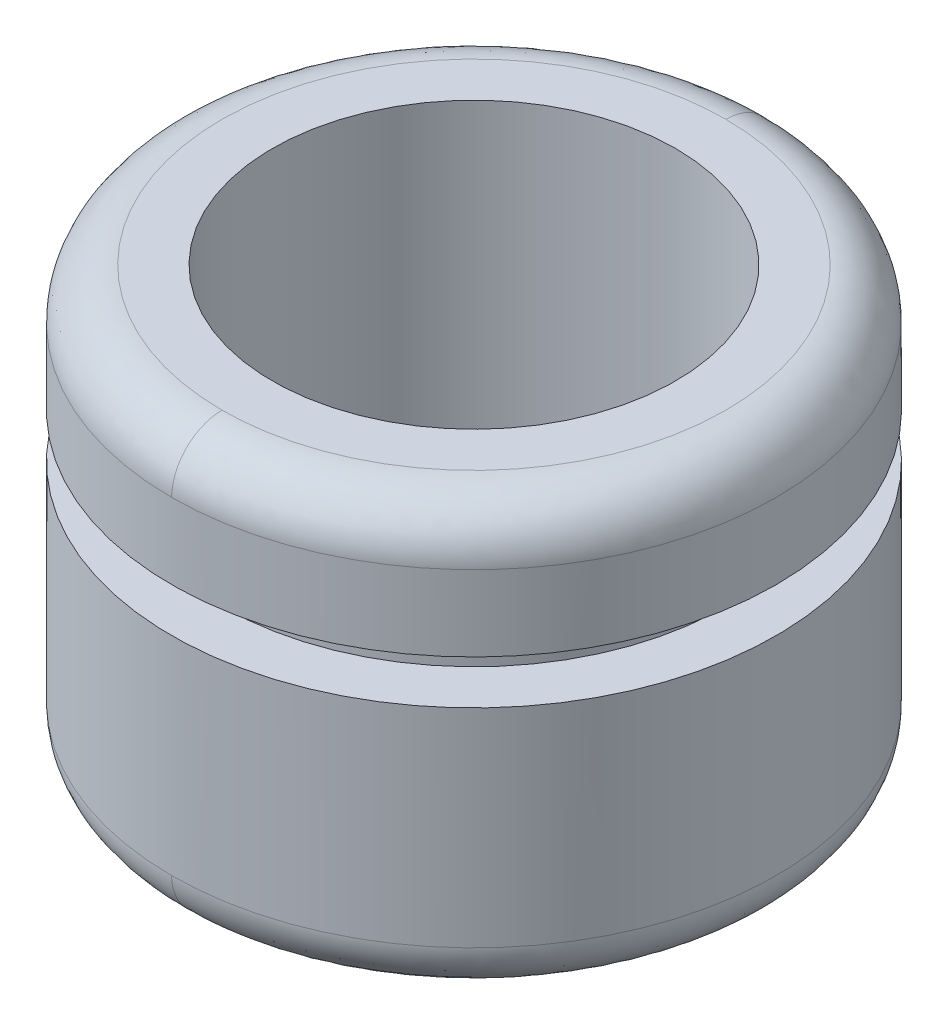
ISO-10303-21;
HEADER;
FILE_DESCRIPTION(('STEP AP214'),'2;1');
FILE_NAME('part.step','',(''),(''),'','','');
FILE_SCHEMA(('AUTOMOTIVE_DESIGN { 1 0 10303 214 1 1 1 1 }'));
ENDSEC;
DATA;
#1=APPLICATION_CONTEXT('core data for automotive mechanical design processes');
#2=APPLICATION_PROTOCOL_DEFINITION('international standard','automotive_design',2000,#1);
#3=PRODUCT_CONTEXT('',#1,'mechanical');
#4=PRODUCT('Part','Part','',(#3));
#5=PRODUCT_RELATED_PRODUCT_CATEGORY('part','',(#4));
#6=PRODUCT_DEFINITION_FORMATION('','',#4);
#7=PRODUCT_DEFINITION_CONTEXT('part definition',#1,'design');
#8=PRODUCT_DEFINITION('design','',#6,#7);
#9=PRODUCT_DEFINITION_SHAPE('','',#8);
#10=(LENGTH_UNIT() NAMED_UNIT(*) SI_UNIT(.MILLI.,.METRE.));
#11=(NAMED_UNIT(*) PLANE_ANGLE_UNIT() SI_UNIT($,.RADIAN.));
#12=(NAMED_UNIT(*) SI_UNIT($,.STERADIAN.) SOLID_ANGLE_UNIT());
#13=UNCERTAINTY_MEASURE_WITH_UNIT(LENGTH_MEASURE(1.E-05),#10,'distance_accuracy_value','');
#14=(GEOMETRIC_REPRESENTATION_CONTEXT(3) GLOBAL_UNCERTAINTY_ASSIGNED_CONTEXT((#13)) GLOBAL_UNIT_ASSIGNED_CONTEXT((#10,
#11,#12)) REPRESENTATION_CONTEXT('',''));
#15=CARTESIAN_POINT('',(0.,0.,0.));
#16=DIRECTION('',(0.,0.,1.));
#17=DIRECTION('',(1.,0.,0.));
#18=AXIS2_PLACEMENT_3D('',#15,#16,#17);
#19=CARTESIAN_POINT('',(0.,10.25,0.));
#20=DIRECTION('',(0.,-1.,0.));
#21=DIRECTION('',(0.,0.,-1.));
#22=AXIS2_PLACEMENT_3D('',#19,#20,#21);
#23=CYLINDRICAL_SURFACE('',#22,12.);
#24=CARTESIAN_POINT('',(0.,10.25,0.));
#25=DIRECTION('',(0.,-1.,0.));
#26=DIRECTION('',(0.,0.,-1.));
#27=AXIS2_PLACEMENT_3D('',#24,#25,#26);
#28=CIRCLE('',#27,12.);
#29=CARTESIAN_POINT('',(0.,10.25,-12.));
#30=VERTEX_POINT('',#29);
#31=EDGE_CURVE('E21',#30,#30,#28,.F.);
#32=ORIENTED_EDGE('',*,*,#31,.F.);
#33=EDGE_LOOP('',(#32));
#34=FACE_BOUND('',#33,.T.);
#35=CARTESIAN_POINT('',(0.,1.99999999888262,0.));
#36=DIRECTION('',(0.,-1.,0.));
#37=DIRECTION('',(1.,0.,0.));
#38=AXIS2_PLACEMENT_3D('',#35,#36,#37);
#39=CIRCLE('',#38,12.0000000003185);
#40=CARTESIAN_POINT('',(-5.38761770572398E-10,1.99999999916196,-12.0000000002389));
#41=VERTEX_POINT('',#40);
#42=CARTESIAN_POINT('',(-1.23062057109199E-09,1.99999999888262,12.0000000002389));
#43=VERTEX_POINT('',#42);
#44=EDGE_CURVE('E56',#41,#43,#39,.T.);
#45=ORIENTED_EDGE('',*,*,#44,.F.);
#46=CARTESIAN_POINT('',(0.,1.99999999888262,0.));
#47=DIRECTION('',(0.,-1.,0.));
#48=DIRECTION('',(1.,0.,0.));
#49=AXIS2_PLACEMENT_3D('',#46,#47,#48);
#50=CIRCLE('',#49,12.0000000003185);
#51=EDGE_CURVE('E60',#43,#41,#50,.T.);
#52=ORIENTED_EDGE('',*,*,#51,.F.);
#53=EDGE_LOOP('',(#45,#52));
#54=FACE_BOUND('',#53,.T.);
#55=ADVANCED_FACE('F16',(#34,#54),#23,.T.);
#56=CARTESIAN_POINT('',(-12.144,10.25,-12.144));
#57=DIRECTION('',(0.,1.,0.));
#58=DIRECTION('',(0.,0.,1.));
#59=AXIS2_PLACEMENT_3D('',#56,#57,#58);
#60=PLANE('',#59);
#61=CARTESIAN_POINT('',(0.,10.25,0.));
#62=DIRECTION('',(0.,-1.,0.));
#63=DIRECTION('',(0.,0.,-1.));
#64=AXIS2_PLACEMENT_3D('',#61,#62,#63);
#65=CIRCLE('',#64,10.);
#66=CARTESIAN_POINT('',(0.,10.25,-10.));
#67=VERTEX_POINT('',#66);
#68=EDGE_CURVE('E73',#67,#67,#65,.T.);
#69=ORIENTED_EDGE('',*,*,#68,.T.);
#70=EDGE_LOOP('',(#69));
#71=FACE_BOUND('',#70,.T.);
#72=ORIENTED_EDGE('',*,*,#31,.T.);
#73=EDGE_LOOP('',(#72));
#74=FACE_BOUND('',#73,.T.);
#75=ADVANCED_FACE('F102',(#71,#74),#60,.T.);
#76=CARTESIAN_POINT('',(0.,0.009991669,-9.800333167));
#77=CARTESIAN_POINT('',(19.600666333,0.009991669,-9.800333167));
#78=CARTESIAN_POINT('',(19.600666333,0.009991669,9.800333167));
#79=CARTESIAN_POINT('',(0.,0.009991669,9.800333167));
#80=CARTESIAN_POINT('',(0.,-0.126440845,-11.16010753));
#81=CARTESIAN_POINT('',(22.320215061,-0.126440845,-11.16010753));
#82=CARTESIAN_POINT('',(22.320215061,-0.126440845,11.16010753));
#83=CARTESIAN_POINT('',(0.,-0.126440845,11.16010753));
#84=CARTESIAN_POINT('',(0.,0.83989247,-12.126440845));
#85=CARTESIAN_POINT('',(24.252881691,0.83989247,-12.126440845));
#86=CARTESIAN_POINT('',(24.252881691,0.83989247,12.126440845));
#87=CARTESIAN_POINT('',(0.,0.83989247,12.126440845));
#88=CARTESIAN_POINT('',(0.,2.199666833,-11.990008331));
#89=CARTESIAN_POINT('',(23.980016661,2.199666833,-11.990008331));
#90=CARTESIAN_POINT('',(23.980016661,2.199666833,11.990008331));
#91=CARTESIAN_POINT('',(0.,2.199666833,11.990008331));
#92=(BOUNDED_SURFACE() B_SPLINE_SURFACE(3,3,((#76,#77,#78,#79),(#80,#81,#82,#83),(#84,#85,#86,
#87),(#88,#89,#90,#91)),.UNSPECIFIED.,.F.,.F.,.F.) B_SPLINE_SURFACE_WITH_KNOTS((4,4),(4,4),(0.,
1.),(0.,1.),.UNSPECIFIED.) GEOMETRIC_REPRESENTATION_ITEM() RATIONAL_B_SPLINE_SURFACE(((1.,
0.333333333333333,0.333333333333333,1.),(0.755320871117972,0.251773623705991,0.251773623705991,
0.755320871117972),(0.755320871117972,0.251773623705991,0.251773623705991,0.755320871117972),
(1.,0.333333333333333,0.333333333333333,1.))) REPRESENTATION_ITEM('') SURFACE());
#93=CARTESIAN_POINT('',(0.,-3.18488293810218E-10,10.0000000012986));
#94=CARTESIAN_POINT('',(20.0000000018775,-3.1848831384993E-10,10.0000000012986));
#95=CARTESIAN_POINT('',(20.0000000018775,-3.1848831384993E-10,-10.0000000012986));
#96=CARTESIAN_POINT('',(0.,-3.18488293810218E-10,-10.0000000012986));
#97=(BOUNDED_CURVE() B_SPLINE_CURVE(3,(#93,#94,#95,#96),.UNSPECIFIED.,.F.,
.F.) B_SPLINE_CURVE_WITH_KNOTS((4,4),(0.,1.),
.UNSPECIFIED.) CURVE() GEOMETRIC_REPRESENTATION_ITEM() RATIONAL_B_SPLINE_CURVE((0.956578302130087,
0.318859434043362,0.318859434043362,0.956578302130087)) REPRESENTATION_ITEM(''));
#98=CARTESIAN_POINT('',(0.,-1.9109297562994E-10,-9.99999999875893));
#99=VERTEX_POINT('',#98);
#100=CARTESIAN_POINT('',(0.,-1.9109297562994E-10,9.99999999875893));
#101=VERTEX_POINT('',#100);
#102=EDGE_CURVE('E68',#99,#101,#97,.F.);
#103=CARTESIAN_POINT('',(0.,0.009991669,-9.800333167));
#104=CARTESIAN_POINT('',(0.,-0.126440845,-11.16010753));
#105=CARTESIAN_POINT('',(0.,0.83989247,-12.126440845));
#106=CARTESIAN_POINT('',(0.,2.199666833,-11.990008331));
#107=(BOUNDED_CURVE() B_SPLINE_CURVE(3,(#103,#104,#105,#106),.UNSPECIFIED.,.F.,
.F.) B_SPLINE_CURVE_WITH_KNOTS((4,4),(0.,1.),
.UNSPECIFIED.) CURVE() GEOMETRIC_REPRESENTATION_ITEM() RATIONAL_B_SPLINE_CURVE((1.,
0.755320871117972,0.755320871117972,1.)) REPRESENTATION_ITEM(''));
#108=EDGE_CURVE('E65',#41,#99,#107,.F.);
#109=CARTESIAN_POINT('',(0.,0.009991669,9.800333167));
#110=CARTESIAN_POINT('',(0.,-0.126440845,11.16010753));
#111=CARTESIAN_POINT('',(0.,0.83989247,12.126440845));
#112=CARTESIAN_POINT('',(0.,2.199666833,11.990008331));
#113=(BOUNDED_CURVE() B_SPLINE_CURVE(3,(#109,#110,#111,#112),.UNSPECIFIED.,.F.,
.F.) B_SPLINE_CURVE_WITH_KNOTS((4,4),(0.,1.),
.UNSPECIFIED.) CURVE() GEOMETRIC_REPRESENTATION_ITEM() RATIONAL_B_SPLINE_CURVE((1.,
0.755320871117972,0.755320871117972,1.)) REPRESENTATION_ITEM(''));
#114=EDGE_CURVE('E62',#101,#43,#113,.T.);
#115=ORIENTED_EDGE('',*,*,#102,.F.);
#116=ORIENTED_EDGE('',*,*,#108,.F.);
#117=ORIENTED_EDGE('',*,*,#44,.T.);
#118=ORIENTED_EDGE('',*,*,#114,.F.);
#119=EDGE_LOOP('',(#115,#116,#117,#118));
#120=FACE_BOUND('',#119,.T.);
#121=ADVANCED_FACE('F66',(#120),#92,.T.);
#122=CARTESIAN_POINT('',(0.,0.009991669,9.800333167));
#123=CARTESIAN_POINT('',(-19.600666333,0.009991669,9.800333167));
#124=CARTESIAN_POINT('',(-19.600666333,0.009991669,-9.800333167));
#125=CARTESIAN_POINT('',(0.,0.009991669,-9.800333167));
#126=CARTESIAN_POINT('',(0.,-0.126440845,11.16010753));
#127=CARTESIAN_POINT('',(-22.320215061,-0.126440845,11.16010753));
#128=CARTESIAN_POINT('',(-22.320215061,-0.126440845,-11.16010753));
#129=CARTESIAN_POINT('',(0.,-0.126440845,-11.16010753));
#130=CARTESIAN_POINT('',(0.,0.83989247,12.126440845));
#131=CARTESIAN_POINT('',(-24.252881691,0.83989247,12.126440845));
#132=CARTESIAN_POINT('',(-24.252881691,0.83989247,-12.126440845));
#133=CARTESIAN_POINT('',(0.,0.83989247,-12.126440845));
#134=CARTESIAN_POINT('',(0.,2.199666833,11.990008331));
#135=CARTESIAN_POINT('',(-23.980016661,2.199666833,11.990008331));
#136=CARTESIAN_POINT('',(-23.980016661,2.199666833,-11.990008331));
#137=CARTESIAN_POINT('',(0.,2.199666833,-11.990008331));
#138=(BOUNDED_SURFACE() B_SPLINE_SURFACE(3,3,((#122,#123,#124,#125),(#126,#127,#128,#129),(#130,
#131,#132,#133),(#134,#135,#136,#137)),.UNSPECIFIED.,.F.,.F.,
.F.) B_SPLINE_SURFACE_WITH_KNOTS((4,4),(4,4),(0.,1.),(0.,1.),
.UNSPECIFIED.) GEOMETRIC_REPRESENTATION_ITEM() RATIONAL_B_SPLINE_SURFACE(((1.,0.333333333333333,
0.333333333333333,1.),(0.755320871117972,0.251773623705991,0.251773623705991,0.755320871117972),
(0.755320871117972,0.251773623705991,0.251773623705991,0.755320871117972),(1.,0.333333333333333,
0.333333333333333,1.))) REPRESENTATION_ITEM('') SURFACE());
#139=CARTESIAN_POINT('',(0.,-3.18488293078145E-10,-10.0000000012986));
#140=CARTESIAN_POINT('',(-20.0000000018775,-3.18488312654322E-10,-10.0000000012986));
#141=CARTESIAN_POINT('',(-20.0000000018775,-3.18488312654322E-10,10.0000000012986));
#142=CARTESIAN_POINT('',(0.,-3.18488293078145E-10,10.0000000012986));
#143=(BOUNDED_CURVE() B_SPLINE_CURVE(3,(#139,#140,#141,#142),.UNSPECIFIED.,.F.,
.F.) B_SPLINE_CURVE_WITH_KNOTS((4,4),(0.,1.),
.UNSPECIFIED.) CURVE() GEOMETRIC_REPRESENTATION_ITEM() RATIONAL_B_SPLINE_CURVE((0.956578302130087,
0.318859434043362,0.318859434043362,0.956578302130087)) REPRESENTATION_ITEM(''));
#144=EDGE_CURVE('E144',#101,#99,#143,.F.);
#145=ORIENTED_EDGE('',*,*,#108,.T.);
#146=ORIENTED_EDGE('',*,*,#144,.F.);
#147=ORIENTED_EDGE('',*,*,#114,.T.);
#148=ORIENTED_EDGE('',*,*,#51,.T.);
#149=EDGE_LOOP('',(#145,#146,#147,#148));
#150=FACE_BOUND('',#149,.T.);
#151=ADVANCED_FACE('F75',(#150),#138,.T.);
#152=CARTESIAN_POINT('',(0.,12.,0.));
#153=DIRECTION('',(0.,-1.,0.));
#154=DIRECTION('',(0.,0.,-1.));
#155=AXIS2_PLACEMENT_3D('',#152,#153,#154);
#156=CYLINDRICAL_SURFACE('',#155,10.);
#157=CARTESIAN_POINT('',(0.,12.,0.));
#158=DIRECTION('',(0.,-1.,0.));
#159=DIRECTION('',(0.,0.,-1.));
#160=AXIS2_PLACEMENT_3D('',#157,#158,#159);
#161=CIRCLE('',#160,10.);
#162=CARTESIAN_POINT('',(0.,12.,-10.));
#163=VERTEX_POINT('',#162);
#164=EDGE_CURVE('E142',#163,#163,#161,.F.);
#165=ORIENTED_EDGE('',*,*,#164,.F.);
#166=EDGE_LOOP('',(#165));
#167=FACE_BOUND('',#166,.T.);
#168=ORIENTED_EDGE('',*,*,#68,.F.);
#169=EDGE_LOOP('',(#168));
#170=FACE_BOUND('',#169,.T.);
#171=ADVANCED_FACE('F100',(#167,#170),#156,.T.);
#172=CARTESIAN_POINT('',(-10.12,0.,10.12));
#173=DIRECTION('',(0.,-1.,0.));
#174=DIRECTION('',(0.,0.,-1.));
#175=AXIS2_PLACEMENT_3D('',#172,#173,#174);
#176=PLANE('',#175);
#177=CARTESIAN_POINT('',(0.,0.,0.));
#178=DIRECTION('',(0.,-1.,0.));
#179=DIRECTION('',(0.,0.,-1.));
#180=AXIS2_PLACEMENT_3D('',#177,#178,#179);
#181=CIRCLE('',#180,8.);
#182=CARTESIAN_POINT('',(0.,0.,-8.));
#183=VERTEX_POINT('',#182);
#184=EDGE_CURVE('E139',#183,#183,#181,.T.);
#185=ORIENTED_EDGE('',*,*,#184,.F.);
#186=EDGE_LOOP('',(#185));
#187=FACE_BOUND('',#186,.T.);
#188=ORIENTED_EDGE('',*,*,#102,.T.);
#189=ORIENTED_EDGE('',*,*,#144,.T.);
#190=EDGE_LOOP('',(#188,#189));
#191=FACE_BOUND('',#190,.T.);
#192=ADVANCED_FACE('F90',(#187,#191),#176,.T.);
#193=CARTESIAN_POINT('',(-12.144,12.,12.144));
#194=DIRECTION('',(0.,-1.,0.));
#195=DIRECTION('',(0.,0.,-1.));
#196=AXIS2_PLACEMENT_3D('',#193,#194,#195);
#197=PLANE('',#196);
#198=ORIENTED_EDGE('',*,*,#164,.T.);
#199=EDGE_LOOP('',(#198));
#200=FACE_BOUND('',#199,.T.);
#201=CARTESIAN_POINT('',(0.,12.,0.));
#202=DIRECTION('',(0.,-1.,0.));
#203=DIRECTION('',(1.,0.,0.));
#204=AXIS2_PLACEMENT_3D('',#201,#202,#203);
#205=CIRCLE('',#204,12.);
#206=CARTESIAN_POINT('',(12.,12.,0.));
#207=VERTEX_POINT('',#206);
#208=EDGE_CURVE('E136',#207,#207,#205,.T.);
#209=ORIENTED_EDGE('',*,*,#208,.T.);
#210=EDGE_LOOP('',(#209));
#211=FACE_BOUND('',#210,.T.);
#212=ADVANCED_FACE('F99',(#200,#211),#197,.T.);
#213=CARTESIAN_POINT('',(0.,17.,0.));
#214=DIRECTION('',(0.,-1.,0.));
#215=DIRECTION('',(0.,0.,-1.));
#216=AXIS2_PLACEMENT_3D('',#213,#214,#215);
#217=CYLINDRICAL_SURFACE('',#216,8.);
#218=ORIENTED_EDGE('',*,*,#184,.T.);
#219=EDGE_LOOP('',(#218));
#220=FACE_BOUND('',#219,.T.);
#221=CARTESIAN_POINT('',(0.,17.,0.));
#222=DIRECTION('',(0.,-1.,0.));
#223=DIRECTION('',(0.,0.,-1.));
#224=AXIS2_PLACEMENT_3D('',#221,#222,#223);
#225=CIRCLE('',#224,8.);
#226=CARTESIAN_POINT('',(0.,17.,-8.));
#227=VERTEX_POINT('',#226);
#228=EDGE_CURVE('E127',#227,#227,#225,.T.);
#229=ORIENTED_EDGE('',*,*,#228,.F.);
#230=EDGE_LOOP('',(#229));
#231=FACE_BOUND('',#230,.T.);
#232=ADVANCED_FACE('F272',(#220,#231),#217,.F.);
#233=CARTESIAN_POINT('',(0.,15.,0.));
#234=DIRECTION('',(0.,-1.,0.));
#235=DIRECTION('',(1.,0.,0.));
#236=AXIS2_PLACEMENT_3D('',#233,#234,#235);
#237=CYLINDRICAL_SURFACE('',#236,12.);
#238=ORIENTED_EDGE('',*,*,#208,.F.);
#239=EDGE_LOOP('',(#238));
#240=FACE_BOUND('',#239,.T.);
#241=CARTESIAN_POINT('',(0.,15.0000000011174,0.));
#242=DIRECTION('',(0.,1.,0.));
#243=DIRECTION('',(-1.,0.,0.));
#244=AXIS2_PLACEMENT_3D('',#241,#242,#243);
#245=CIRCLE('',#244,12.0000000003185);
#246=CARTESIAN_POINT('',(-1.23062057109199E-09,15.0000000011174,12.0000000002389));
#247=VERTEX_POINT('',#246);
#248=CARTESIAN_POINT('',(0.,15.000000000838,-12.0000000002389));
#249=VERTEX_POINT('',#248);
#250=EDGE_CURVE('E246',#247,#249,#245,.T.);
#251=ORIENTED_EDGE('',*,*,#250,.F.);
#252=CARTESIAN_POINT('',(0.,15.0000000011174,0.));
#253=DIRECTION('',(0.,1.,0.));
#254=DIRECTION('',(-1.,0.,0.));
#255=AXIS2_PLACEMENT_3D('',#252,#253,#254);
#256=CIRCLE('',#255,12.0000000003185);
#257=EDGE_CURVE('E135',#249,#247,#256,.T.);
#258=ORIENTED_EDGE('',*,*,#257,.F.);
#259=EDGE_LOOP('',(#251,#258));
#260=FACE_BOUND('',#259,.T.);
#261=ADVANCED_FACE('F270',(#240,#260),#237,.T.);
#262=CARTESIAN_POINT('',(-10.12,17.,-10.12));
#263=DIRECTION('',(0.,1.,0.));
#264=DIRECTION('',(0.,0.,1.));
#265=AXIS2_PLACEMENT_3D('',#262,#263,#264);
#266=PLANE('',#265);
#267=ORIENTED_EDGE('',*,*,#228,.T.);
#268=EDGE_LOOP('',(#267));
#269=FACE_BOUND('',#268,.T.);
#270=CARTESIAN_POINT('',(0.,17.0000000003185,-10.0000000012986));
#271=CARTESIAN_POINT('',(20.0000000018775,17.0000000003185,-10.0000000012986));
#272=CARTESIAN_POINT('',(20.0000000018775,17.0000000003185,10.0000000012986));
#273=CARTESIAN_POINT('',(0.,17.0000000003185,10.0000000012986));
#274=(BOUNDED_CURVE() B_SPLINE_CURVE(3,(#270,#271,#272,#273),.UNSPECIFIED.,.F.,
.F.) B_SPLINE_CURVE_WITH_KNOTS((4,4),(0.,1.),
.UNSPECIFIED.) CURVE() GEOMETRIC_REPRESENTATION_ITEM() RATIONAL_B_SPLINE_CURVE((0.956578302130087,
0.318859434043362,0.318859434043362,0.956578302130087)) REPRESENTATION_ITEM(''));
#275=CARTESIAN_POINT('',(0.,17.0000000001911,-9.99999999875893));
#276=VERTEX_POINT('',#275);
#277=CARTESIAN_POINT('',(0.,17.0000000001911,9.99999999875893));
#278=VERTEX_POINT('',#277);
#279=EDGE_CURVE('E27',#276,#278,#274,.T.);
#280=ORIENTED_EDGE('',*,*,#279,.F.);
#281=CARTESIAN_POINT('',(0.,17.0000000003185,10.0000000012986));
#282=CARTESIAN_POINT('',(-20.0000000018775,17.0000000003185,10.0000000012986));
#283=CARTESIAN_POINT('',(-20.0000000018775,17.0000000003185,-10.0000000012986));
#284=CARTESIAN_POINT('',(0.,17.0000000003185,-10.0000000012986));
#285=(BOUNDED_CURVE() B_SPLINE_CURVE(3,(#281,#282,#283,#284),.UNSPECIFIED.,.F.,
.F.) B_SPLINE_CURVE_WITH_KNOTS((4,4),(0.,1.),
.UNSPECIFIED.) CURVE() GEOMETRIC_REPRESENTATION_ITEM() RATIONAL_B_SPLINE_CURVE((0.956578302130087,
0.318859434043362,0.318859434043362,0.956578302130087)) REPRESENTATION_ITEM(''));
#286=EDGE_CURVE('E35',#278,#276,#285,.T.);
#287=ORIENTED_EDGE('',*,*,#286,.F.);
#288=EDGE_LOOP('',(#280,#287));
#289=FACE_BOUND('',#288,.T.);
#290=ADVANCED_FACE('F18',(#269,#289),#266,.T.);
#291=CARTESIAN_POINT('',(0.,16.990008331,-9.800333167));
#292=CARTESIAN_POINT('',(-19.600666333,16.990008331,-9.800333167));
#293=CARTESIAN_POINT('',(-19.600666333,16.990008331,9.800333167));
#294=CARTESIAN_POINT('',(0.,16.990008331,9.800333167));
#295=CARTESIAN_POINT('',(0.,17.126440845,-11.16010753));
#296=CARTESIAN_POINT('',(-22.320215061,17.126440845,-11.16010753));
#297=CARTESIAN_POINT('',(-22.320215061,17.126440845,11.16010753));
#298=CARTESIAN_POINT('',(0.,17.126440845,11.16010753));
#299=CARTESIAN_POINT('',(0.,16.16010753,-12.126440845));
#300=CARTESIAN_POINT('',(-24.252881691,16.16010753,-12.126440845));
#301=CARTESIAN_POINT('',(-24.252881691,16.16010753,12.126440845));
#302=CARTESIAN_POINT('',(0.,16.16010753,12.126440845));
#303=CARTESIAN_POINT('',(0.,14.800333167,-11.990008331));
#304=CARTESIAN_POINT('',(-23.980016661,14.800333167,-11.990008331));
#305=CARTESIAN_POINT('',(-23.980016661,14.800333167,11.990008331));
#306=CARTESIAN_POINT('',(0.,14.800333167,11.990008331));
#307=(BOUNDED_SURFACE() B_SPLINE_SURFACE(3,3,((#291,#292,#293,#294),(#295,#296,#297,#298),(#299,
#300,#301,#302),(#303,#304,#305,#306)),.UNSPECIFIED.,.F.,.F.,
.F.) B_SPLINE_SURFACE_WITH_KNOTS((4,4),(4,4),(0.,1.),(0.,1.),
.UNSPECIFIED.) GEOMETRIC_REPRESENTATION_ITEM() RATIONAL_B_SPLINE_SURFACE(((1.,0.333333333333333,
0.333333333333333,1.),(0.755320871117972,0.251773623705991,0.251773623705991,0.755320871117972),
(0.755320871117972,0.251773623705991,0.251773623705991,0.755320871117972),(1.,0.333333333333333,
0.333333333333333,1.))) REPRESENTATION_ITEM('') SURFACE());
#308=CARTESIAN_POINT('',(0.,16.990008331,9.800333167));
#309=CARTESIAN_POINT('',(0.,17.126440845,11.16010753));
#310=CARTESIAN_POINT('',(0.,16.16010753,12.126440845));
#311=CARTESIAN_POINT('',(0.,14.800333167,11.990008331));
#312=(BOUNDED_CURVE() B_SPLINE_CURVE(3,(#308,#309,#310,#311),.UNSPECIFIED.,.F.,
.F.) B_SPLINE_CURVE_WITH_KNOTS((4,4),(0.,1.),
.UNSPECIFIED.) CURVE() GEOMETRIC_REPRESENTATION_ITEM() RATIONAL_B_SPLINE_CURVE((1.,
0.755320871117972,0.755320871117972,1.)) REPRESENTATION_ITEM(''));
#313=EDGE_CURVE('E11',#278,#247,#312,.T.);
#314=CARTESIAN_POINT('',(0.,16.990008331,-9.800333167));
#315=CARTESIAN_POINT('',(0.,17.126440845,-11.16010753));
#316=CARTESIAN_POINT('',(0.,16.16010753,-12.126440845));
#317=CARTESIAN_POINT('',(0.,14.800333167,-11.990008331));
#318=(BOUNDED_CURVE() B_SPLINE_CURVE(3,(#314,#315,#316,#317),.UNSPECIFIED.,.F.,
.F.) B_SPLINE_CURVE_WITH_KNOTS((4,4),(0.,1.),
.UNSPECIFIED.) CURVE() GEOMETRIC_REPRESENTATION_ITEM() RATIONAL_B_SPLINE_CURVE((1.,
0.755320871117972,0.755320871117972,1.)) REPRESENTATION_ITEM(''));
#319=EDGE_CURVE('E239',#249,#276,#318,.F.);
#320=ORIENTED_EDGE('',*,*,#313,.F.);
#321=ORIENTED_EDGE('',*,*,#286,.T.);
#322=ORIENTED_EDGE('',*,*,#319,.F.);
#323=ORIENTED_EDGE('',*,*,#257,.T.);
#324=EDGE_LOOP('',(#320,#321,#322,#323));
#325=FACE_BOUND('',#324,.T.);
#326=ADVANCED_FACE('F215',(#325),#307,.T.);
#327=CARTESIAN_POINT('',(0.,16.990008331,9.800333167));
#328=CARTESIAN_POINT('',(19.600666333,16.990008331,9.800333167));
#329=CARTESIAN_POINT('',(19.600666333,16.990008331,-9.800333167));
#330=CARTESIAN_POINT('',(0.,16.990008331,-9.800333167));
#331=CARTESIAN_POINT('',(0.,17.126440845,11.16010753));
#332=CARTESIAN_POINT('',(22.320215061,17.126440845,11.16010753));
#333=CARTESIAN_POINT('',(22.320215061,17.126440845,-11.16010753));
#334=CARTESIAN_POINT('',(0.,17.126440845,-11.16010753));
#335=CARTESIAN_POINT('',(0.,16.16010753,12.126440845));
#336=CARTESIAN_POINT('',(24.252881691,16.16010753,12.126440845));
#337=CARTESIAN_POINT('',(24.252881691,16.16010753,-12.126440845));
#338=CARTESIAN_POINT('',(0.,16.16010753,-12.126440845));
#339=CARTESIAN_POINT('',(0.,14.800333167,11.990008331));
#340=CARTESIAN_POINT('',(23.980016661,14.800333167,11.990008331));
#341=CARTESIAN_POINT('',(23.980016661,14.800333167,-11.990008331));
#342=CARTESIAN_POINT('',(0.,14.800333167,-11.990008331));
#343=(BOUNDED_SURFACE() B_SPLINE_SURFACE(3,3,((#327,#328,#329,#330),(#331,#332,#333,#334),(#335,
#336,#337,#338),(#339,#340,#341,#342)),.UNSPECIFIED.,.F.,.F.,
.F.) B_SPLINE_SURFACE_WITH_KNOTS((4,4),(4,4),(0.,1.),(0.,1.),
.UNSPECIFIED.) GEOMETRIC_REPRESENTATION_ITEM() RATIONAL_B_SPLINE_SURFACE(((1.,0.333333333333333,
0.333333333333333,1.),(0.755320871117972,0.251773623705991,0.251773623705991,0.755320871117972),
(0.755320871117972,0.251773623705991,0.251773623705991,0.755320871117972),(1.,0.333333333333333,
0.333333333333333,1.))) REPRESENTATION_ITEM('') SURFACE());
#344=ORIENTED_EDGE('',*,*,#279,.T.);
#345=ORIENTED_EDGE('',*,*,#313,.T.);
#346=ORIENTED_EDGE('',*,*,#250,.T.);
#347=ORIENTED_EDGE('',*,*,#319,.T.);
#348=EDGE_LOOP('',(#344,#345,#346,#347));
#349=FACE_BOUND('',#348,.T.);
#350=ADVANCED_FACE('F213',(#349),#343,.T.);
#351=CLOSED_SHELL('',(#55,#75,#121,#151,#171,#192,#212,#232,#261,#290,#326,#350));
#352=MANIFOLD_SOLID_BREP('B1',#351);
#353=ADVANCED_BREP_SHAPE_REPRESENTATION('',(#18,#352),#14);
#354=SHAPE_DEFINITION_REPRESENTATION(#9,#353);
ENDSEC;
END-ISO-10303-21;
